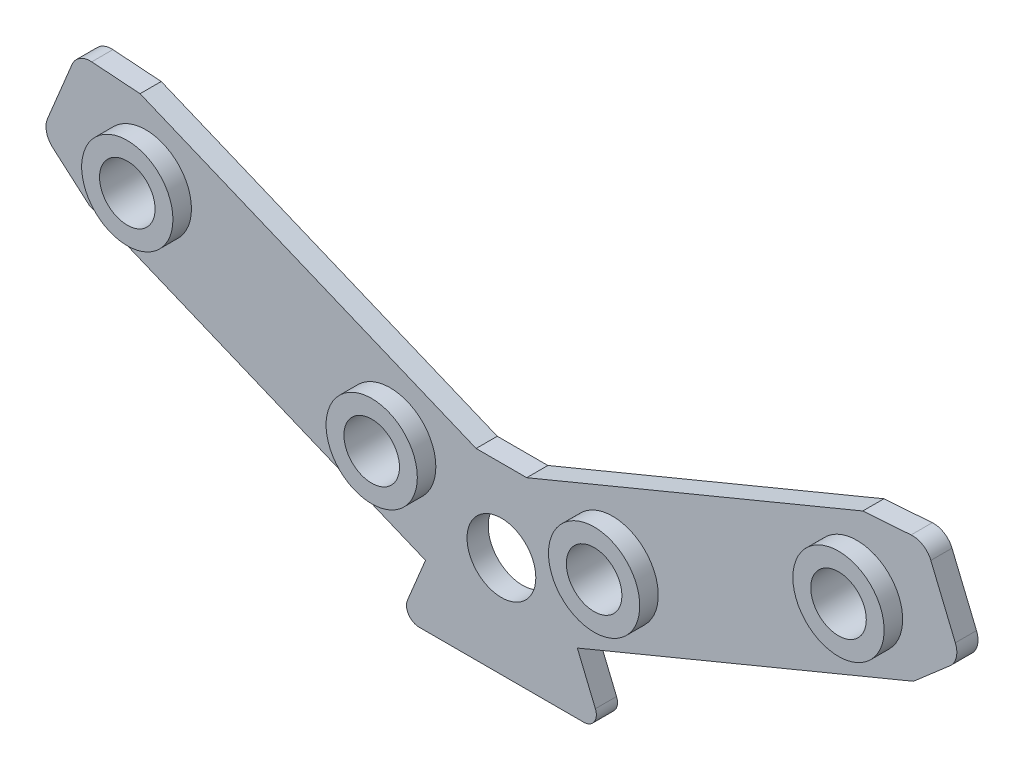
ISO-10303-21;
HEADER;
FILE_DESCRIPTION(('STEP AP214'),'2;1');
FILE_NAME('part.step','',(''),(''),'','','');
FILE_SCHEMA(('AUTOMOTIVE_DESIGN { 1 0 10303 214 1 1 1 1 }'));
ENDSEC;
DATA;
#1=APPLICATION_CONTEXT('core data for automotive mechanical design processes');
#2=APPLICATION_PROTOCOL_DEFINITION('international standard','automotive_design',2000,#1);
#3=PRODUCT_CONTEXT('',#1,'mechanical');
#4=PRODUCT('Part','Part','',(#3));
#5=PRODUCT_RELATED_PRODUCT_CATEGORY('part','',(#4));
#6=PRODUCT_DEFINITION_FORMATION('','',#4);
#7=PRODUCT_DEFINITION_CONTEXT('part definition',#1,'design');
#8=PRODUCT_DEFINITION('design','',#6,#7);
#9=PRODUCT_DEFINITION_SHAPE('','',#8);
#10=(LENGTH_UNIT() NAMED_UNIT(*) SI_UNIT(.MILLI.,.METRE.));
#11=(NAMED_UNIT(*) PLANE_ANGLE_UNIT() SI_UNIT($,.RADIAN.));
#12=(NAMED_UNIT(*) SI_UNIT($,.STERADIAN.) SOLID_ANGLE_UNIT());
#13=UNCERTAINTY_MEASURE_WITH_UNIT(LENGTH_MEASURE(1.E-05),#10,'distance_accuracy_value','');
#14=(GEOMETRIC_REPRESENTATION_CONTEXT(3) GLOBAL_UNCERTAINTY_ASSIGNED_CONTEXT((#13)) GLOBAL_UNIT_ASSIGNED_CONTEXT((#10,
#11,#12)) REPRESENTATION_CONTEXT('',''));
#15=CARTESIAN_POINT('',(0.,0.,0.));
#16=DIRECTION('',(0.,0.,1.));
#17=DIRECTION('',(1.,0.,0.));
#18=AXIS2_PLACEMENT_3D('',#15,#16,#17);
#19=CARTESIAN_POINT('',(-6.21700995331753,-6.69363433460637,1.6));
#20=DIRECTION('',(0.,0.,1.));
#21=DIRECTION('',(1.,0.,0.));
#22=AXIS2_PLACEMENT_3D('',#19,#20,#21);
#23=PLANE('',#22);
#24=CARTESIAN_POINT('',(-8.4073037458527,3.48241923452234,1.6));
#25=DIRECTION('',(0.,0.,1.));
#26=DIRECTION('',(1.,0.,0.));
#27=AXIS2_PLACEMENT_3D('',#24,#25,#26);
#28=CIRCLE('',#27,3.45);
#29=CARTESIAN_POINT('',(-4.9573037458527,3.48241923452234,1.6));
#30=VERTEX_POINT('',#29);
#31=EDGE_CURVE('E454',#30,#30,#28,.T.);
#32=ORIENTED_EDGE('',*,*,#31,.F.);
#33=EDGE_LOOP('',(#32));
#34=FACE_BOUND('',#33,.T.);
#35=CARTESIAN_POINT('',(26.8848943960784,11.1360878818242,1.6));
#36=DIRECTION('',(0.,0.,1.));
#37=DIRECTION('',(-1.,0.,0.));
#38=AXIS2_PLACEMENT_3D('',#35,#36,#37);
#39=CIRCLE('',#38,3.45);
#40=CARTESIAN_POINT('',(23.4348943960784,11.1360878818242,1.6));
#41=VERTEX_POINT('',#40);
#42=EDGE_CURVE('E466',#41,#41,#39,.T.);
#43=ORIENTED_EDGE('',*,*,#42,.F.);
#44=EDGE_LOOP('',(#43));
#45=FACE_BOUND('',#44,.T.);
#46=CARTESIAN_POINT('',(-6.21700995331753,-6.69363433460637,1.6));
#47=DIRECTION('',(0.,0.,1.));
#48=DIRECTION('',(1.,0.,0.));
#49=AXIS2_PLACEMENT_3D('',#46,#47,#48);
#50=CIRCLE('',#49,0.959999999999999);
#51=CARTESIAN_POINT('',(-7.10393430452836,-6.32625823953589,1.6));
#52=VERTEX_POINT('',#51);
#53=CARTESIAN_POINT('',(-6.21700995331753,-7.65363433460637,1.6));
#54=VERTEX_POINT('',#53);
#55=EDGE_CURVE('E243',#52,#54,#50,.T.);
#56=ORIENTED_EDGE('',*,*,#55,.T.);
#57=DIRECTION('',(1.,0.,0.));
#58=VECTOR('',#57,1.);
#59=CARTESIAN_POINT('',(6.21700995331753,-7.65363433460637,1.6));
#60=LINE('',#59,#58);
#61=CARTESIAN_POINT('',(6.21700995331753,-7.65363433460637,1.6));
#62=VERTEX_POINT('',#61);
#63=EDGE_CURVE('E131',#54,#62,#60,.T.);
#64=ORIENTED_EDGE('',*,*,#63,.T.);
#65=CARTESIAN_POINT('',(6.21700995331753,-6.69363433460637,1.6));
#66=DIRECTION('',(0.,0.,1.));
#67=DIRECTION('',(-1.,0.,0.));
#68=AXIS2_PLACEMENT_3D('',#65,#66,#67);
#69=CIRCLE('',#68,0.959999999999999);
#70=CARTESIAN_POINT('',(7.10393430452836,-6.32625823953589,1.6));
#71=VERTEX_POINT('',#70);
#72=EDGE_CURVE('E294',#62,#71,#69,.T.);
#73=ORIENTED_EDGE('',*,*,#72,.T.);
#74=DIRECTION('',(-0.382683432365094,0.923879532511285,0.));
#75=VECTOR('',#74,1.);
#76=CARTESIAN_POINT('',(5.74033432365094,-3.03423667204995,1.6));
#77=LINE('',#76,#75);
#78=CARTESIAN_POINT('',(5.74033432365094,-3.03423667204995,1.6));
#79=VERTEX_POINT('',#78);
#80=EDGE_CURVE('E313',#71,#79,#77,.T.);
#81=ORIENTED_EDGE('',*,*,#80,.T.);
#82=DIRECTION('',(0.923879532511285,0.382683432365093,0.));
#83=VECTOR('',#82,1.);
#84=CARTESIAN_POINT('',(5.74033432365094,-3.03423667204995,1.6));
#85=LINE('',#84,#83);
#86=CARTESIAN_POINT('',(31.1470214677113,7.48955771799011,1.6));
#87=VERTEX_POINT('',#86);
#88=EDGE_CURVE('E310',#79,#87,#85,.T.);
#89=ORIENTED_EDGE('',*,*,#88,.T.);
#90=DIRECTION('',(0.755453954995703,0.655201741360133,0.));
#91=VECTOR('',#90,1.);
#92=CARTESIAN_POINT('',(31.1470214677113,7.48955771799011,1.6));
#93=LINE('',#92,#91);
#94=CARTESIAN_POINT('',(33.9137036103779,9.88908841827675,1.6));
#95=VERTEX_POINT('',#94);
#96=EDGE_CURVE('E312',#87,#95,#93,.T.);
#97=ORIENTED_EDGE('',*,*,#96,.T.);
#98=CARTESIAN_POINT('',(32.9309009983377,11.0222693507703,1.6));
#99=DIRECTION('',(0.,0.,1.));
#100=DIRECTION('',(1.,0.,0.));
#101=AXIS2_PLACEMENT_3D('',#98,#99,#100);
#102=CIRCLE('',#101,1.5);
#103=CARTESIAN_POINT('',(34.3167202971046,11.596294499318,1.6));
#104=VERTEX_POINT('',#103);
#105=EDGE_CURVE('E315',#95,#104,#102,.T.);
#106=ORIENTED_EDGE('',*,*,#105,.T.);
#107=DIRECTION('',(-0.382683432365094,0.923879532511285,0.));
#108=VECTOR('',#107,1.);
#109=CARTESIAN_POINT('',(32.4654041072686,16.065767153061,1.6));
#110=LINE('',#109,#108);
#111=CARTESIAN_POINT('',(32.4654041072686,16.065767153061,1.6));
#112=VERTEX_POINT('',#111);
#113=EDGE_CURVE('E321',#104,#112,#110,.T.);
#114=ORIENTED_EDGE('',*,*,#113,.T.);
#115=CARTESIAN_POINT('',(31.0795848085016,15.4917420045133,1.6));
#116=DIRECTION('',(0.,0.,1.));
#117=DIRECTION('',(-1.,0.,0.));
#118=AXIS2_PLACEMENT_3D('',#115,#116,#117);
#119=CIRCLE('',#118,1.5);
#120=CARTESIAN_POINT('',(30.9732512783656,16.9879683177323,1.6));
#121=VERTEX_POINT('',#120);
#122=EDGE_CURVE('E323',#112,#121,#119,.T.);
#123=ORIENTED_EDGE('',*,*,#122,.T.);
#124=DIRECTION('',(-0.997484208812642,-0.0708890200906806,0.));
#125=VECTOR('',#124,1.);
#126=CARTESIAN_POINT('',(27.3201871440603,16.728353043103,1.6));
#127=LINE('',#126,#125);
#128=CARTESIAN_POINT('',(27.3201871440603,16.728353043103,1.6));
#129=VERTEX_POINT('',#128);
#130=EDGE_CURVE('E325',#121,#129,#127,.T.);
#131=ORIENTED_EDGE('',*,*,#130,.T.);
#132=DIRECTION('',(-0.923879532511285,-0.382683432365094,0.));
#133=VECTOR('',#132,1.);
#134=CARTESIAN_POINT('',(1.9135,6.2045586530629,1.6));
#135=LINE('',#134,#133);
#136=CARTESIAN_POINT('',(1.9135,6.2045586530629,1.6));
#137=VERTEX_POINT('',#136);
#138=EDGE_CURVE('E327',#129,#137,#135,.T.);
#139=ORIENTED_EDGE('',*,*,#138,.T.);
#140=DIRECTION('',(-1.,0.,0.));
#141=VECTOR('',#140,1.);
#142=CARTESIAN_POINT('',(-1.9135,6.2045586530629,1.6));
#143=LINE('',#142,#141);
#144=CARTESIAN_POINT('',(-1.9135,6.2045586530629,1.6));
#145=VERTEX_POINT('',#144);
#146=EDGE_CURVE('E329',#137,#145,#143,.T.);
#147=ORIENTED_EDGE('',*,*,#146,.T.);
#148=DIRECTION('',(-0.923879532511285,0.382683432365094,0.));
#149=VECTOR('',#148,1.);
#150=CARTESIAN_POINT('',(-1.9135,6.2045586530629,1.6));
#151=LINE('',#150,#149);
#152=CARTESIAN_POINT('',(-27.3201871440603,16.728353043103,1.6));
#153=VERTEX_POINT('',#152);
#154=EDGE_CURVE('E331',#145,#153,#151,.T.);
#155=ORIENTED_EDGE('',*,*,#154,.T.);
#156=DIRECTION('',(-0.997484208812642,0.0708890200906806,0.));
#157=VECTOR('',#156,1.);
#158=CARTESIAN_POINT('',(-27.3201871440603,16.728353043103,1.6));
#159=LINE('',#158,#157);
#160=CARTESIAN_POINT('',(-30.9732512783656,16.9879683177323,1.6));
#161=VERTEX_POINT('',#160);
#162=EDGE_CURVE('E333',#153,#161,#159,.T.);
#163=ORIENTED_EDGE('',*,*,#162,.T.);
#164=CARTESIAN_POINT('',(-31.0795848085016,15.4917420045133,1.6));
#165=DIRECTION('',(0.,0.,1.));
#166=DIRECTION('',(-1.,0.,0.));
#167=AXIS2_PLACEMENT_3D('',#164,#165,#166);
#168=CIRCLE('',#167,1.5);
#169=CARTESIAN_POINT('',(-32.4654041072686,16.065767153061,1.6));
#170=VERTEX_POINT('',#169);
#171=EDGE_CURVE('E335',#161,#170,#168,.T.);
#172=ORIENTED_EDGE('',*,*,#171,.T.);
#173=DIRECTION('',(-0.382683432365094,-0.923879532511285,0.));
#174=VECTOR('',#173,1.);
#175=CARTESIAN_POINT('',(-32.4654041072686,16.065767153061,1.6));
#176=LINE('',#175,#174);
#177=CARTESIAN_POINT('',(-34.3167202971046,11.5962944993179,1.6));
#178=VERTEX_POINT('',#177);
#179=EDGE_CURVE('E337',#170,#178,#176,.T.);
#180=ORIENTED_EDGE('',*,*,#179,.T.);
#181=CARTESIAN_POINT('',(-32.9309009983377,11.0222693507703,1.6));
#182=DIRECTION('',(0.,0.,1.));
#183=DIRECTION('',(-1.,0.,0.));
#184=AXIS2_PLACEMENT_3D('',#181,#182,#183);
#185=CIRCLE('',#184,1.5);
#186=CARTESIAN_POINT('',(-33.9137036103779,9.88908841827676,1.6));
#187=VERTEX_POINT('',#186);
#188=EDGE_CURVE('E186',#178,#187,#185,.T.);
#189=ORIENTED_EDGE('',*,*,#188,.T.);
#190=DIRECTION('',(0.7554539549957,-0.655201741360137,0.));
#191=VECTOR('',#190,1.);
#192=CARTESIAN_POINT('',(-31.1470214677113,7.48955771799011,1.6));
#193=LINE('',#192,#191);
#194=CARTESIAN_POINT('',(-31.1470214677113,7.48955771799011,1.6));
#195=VERTEX_POINT('',#194);
#196=EDGE_CURVE('E180',#187,#195,#193,.T.);
#197=ORIENTED_EDGE('',*,*,#196,.T.);
#198=DIRECTION('',(0.923879532511285,-0.382683432365093,0.));
#199=VECTOR('',#198,1.);
#200=CARTESIAN_POINT('',(-5.74033432365094,-3.03423667204995,1.6));
#201=LINE('',#200,#199);
#202=CARTESIAN_POINT('',(-5.74033432365094,-3.03423667204995,1.6));
#203=VERTEX_POINT('',#202);
#204=EDGE_CURVE('E184',#195,#203,#201,.T.);
#205=ORIENTED_EDGE('',*,*,#204,.T.);
#206=DIRECTION('',(-0.382683432365094,-0.923879532511285,0.));
#207=VECTOR('',#206,1.);
#208=CARTESIAN_POINT('',(-5.74033432365094,-3.03423667204995,1.6));
#209=LINE('',#208,#207);
#210=EDGE_CURVE('E52',#203,#52,#209,.T.);
#211=ORIENTED_EDGE('',*,*,#210,.T.);
#212=EDGE_LOOP('',(#56,#64,#73,#81,#89,#97,#106,#114,#123,#131,#139,#147,#155,#163,#172,#180,
#189,#197,#205,#211));
#213=FACE_BOUND('',#212,.T.);
#214=CARTESIAN_POINT('',(0.,0.,1.6));
#215=DIRECTION('',(0.,0.,1.));
#216=DIRECTION('',(1.,0.,0.));
#217=AXIS2_PLACEMENT_3D('',#214,#215,#216);
#218=CIRCLE('',#217,2.6);
#219=CARTESIAN_POINT('',(2.6,0.,1.6));
#220=VERTEX_POINT('',#219);
#221=EDGE_CURVE('E208',#220,#220,#218,.T.);
#222=ORIENTED_EDGE('',*,*,#221,.F.);
#223=EDGE_LOOP('',(#222));
#224=FACE_BOUND('',#223,.T.);
#225=CARTESIAN_POINT('',(8.4073037458527,3.48241923452234,1.6));
#226=DIRECTION('',(0.,0.,1.));
#227=DIRECTION('',(-1.,0.,0.));
#228=AXIS2_PLACEMENT_3D('',#225,#226,#227);
#229=CIRCLE('',#228,3.45);
#230=CARTESIAN_POINT('',(4.9573037458527,3.48241923452234,1.6));
#231=VERTEX_POINT('',#230);
#232=EDGE_CURVE('E460',#231,#231,#229,.T.);
#233=ORIENTED_EDGE('',*,*,#232,.F.);
#234=EDGE_LOOP('',(#233));
#235=FACE_BOUND('',#234,.T.);
#236=CARTESIAN_POINT('',(-26.8848943960784,11.1360878818242,1.6));
#237=DIRECTION('',(0.,0.,1.));
#238=DIRECTION('',(1.,0.,0.));
#239=AXIS2_PLACEMENT_3D('',#236,#237,#238);
#240=CIRCLE('',#239,3.45);
#241=CARTESIAN_POINT('',(-23.4348943960784,11.1360878818242,1.6));
#242=VERTEX_POINT('',#241);
#243=EDGE_CURVE('E450',#242,#242,#240,.T.);
#244=ORIENTED_EDGE('',*,*,#243,.F.);
#245=EDGE_LOOP('',(#244));
#246=FACE_BOUND('',#245,.T.);
#247=ADVANCED_FACE('F35',(#34,#45,#213,#224,#235,#246),#23,.T.);
#248=CARTESIAN_POINT('',(-6.21700995331753,-6.69363433460637,0.));
#249=DIRECTION('',(0.,0.,1.));
#250=DIRECTION('',(1.,0.,0.));
#251=AXIS2_PLACEMENT_3D('',#248,#249,#250);
#252=PLANE('',#251);
#253=CARTESIAN_POINT('',(26.8848943960784,11.1360878818242,0.));
#254=DIRECTION('',(0.,0.,1.));
#255=DIRECTION('',(1.,0.,0.));
#256=AXIS2_PLACEMENT_3D('',#253,#254,#255);
#257=CIRCLE('',#256,2.1);
#258=CARTESIAN_POINT('',(28.9848943960784,11.1360878818242,0.));
#259=VERTEX_POINT('',#258);
#260=EDGE_CURVE('E425',#259,#259,#257,.T.);
#261=ORIENTED_EDGE('',*,*,#260,.T.);
#262=EDGE_LOOP('',(#261));
#263=FACE_BOUND('',#262,.T.);
#264=CARTESIAN_POINT('',(8.4073037458527,3.48241923452234,0.));
#265=DIRECTION('',(0.,0.,1.));
#266=DIRECTION('',(1.,0.,0.));
#267=AXIS2_PLACEMENT_3D('',#264,#265,#266);
#268=CIRCLE('',#267,2.1);
#269=CARTESIAN_POINT('',(10.5073037458527,3.48241923452234,0.));
#270=VERTEX_POINT('',#269);
#271=EDGE_CURVE('E435',#270,#270,#268,.T.);
#272=ORIENTED_EDGE('',*,*,#271,.T.);
#273=EDGE_LOOP('',(#272));
#274=FACE_BOUND('',#273,.T.);
#275=CARTESIAN_POINT('',(-8.4073037458527,3.48241923452234,0.));
#276=DIRECTION('',(0.,0.,1.));
#277=DIRECTION('',(1.,0.,0.));
#278=AXIS2_PLACEMENT_3D('',#275,#276,#277);
#279=CIRCLE('',#278,2.1);
#280=CARTESIAN_POINT('',(-6.3073037458527,3.48241923452234,0.));
#281=VERTEX_POINT('',#280);
#282=EDGE_CURVE('E441',#281,#281,#279,.T.);
#283=ORIENTED_EDGE('',*,*,#282,.T.);
#284=EDGE_LOOP('',(#283));
#285=FACE_BOUND('',#284,.T.);
#286=CARTESIAN_POINT('',(-26.8848943960784,11.1360878818242,0.));
#287=DIRECTION('',(0.,0.,1.));
#288=DIRECTION('',(1.,0.,0.));
#289=AXIS2_PLACEMENT_3D('',#286,#287,#288);
#290=CIRCLE('',#289,2.1);
#291=CARTESIAN_POINT('',(-24.7848943960784,11.1360878818242,0.));
#292=VERTEX_POINT('',#291);
#293=EDGE_CURVE('E447',#292,#292,#290,.T.);
#294=ORIENTED_EDGE('',*,*,#293,.T.);
#295=EDGE_LOOP('',(#294));
#296=FACE_BOUND('',#295,.T.);
#297=CARTESIAN_POINT('',(-6.21700995331753,-6.69363433460637,0.));
#298=DIRECTION('',(0.,0.,1.));
#299=DIRECTION('',(1.,0.,0.));
#300=AXIS2_PLACEMENT_3D('',#297,#298,#299);
#301=CIRCLE('',#300,0.959999999999999);
#302=CARTESIAN_POINT('',(-7.10393430452836,-6.32625823953589,0.));
#303=VERTEX_POINT('',#302);
#304=CARTESIAN_POINT('',(-6.21700995331753,-7.65363433460637,0.));
#305=VERTEX_POINT('',#304);
#306=EDGE_CURVE('E204',#303,#305,#301,.T.);
#307=ORIENTED_EDGE('',*,*,#306,.F.);
#308=DIRECTION('',(-0.382683432365094,-0.923879532511285,0.));
#309=VECTOR('',#308,1.);
#310=CARTESIAN_POINT('',(-5.74033432365094,-3.03423667204995,0.));
#311=LINE('',#310,#309);
#312=CARTESIAN_POINT('',(-5.74033432365094,-3.03423667204995,0.));
#313=VERTEX_POINT('',#312);
#314=EDGE_CURVE('E123',#313,#303,#311,.T.);
#315=ORIENTED_EDGE('',*,*,#314,.F.);
#316=DIRECTION('',(0.923879532511285,-0.382683432365093,0.));
#317=VECTOR('',#316,1.);
#318=CARTESIAN_POINT('',(-5.74033432365094,-3.03423667204995,0.));
#319=LINE('',#318,#317);
#320=CARTESIAN_POINT('',(-31.1470214677113,7.48955771799011,0.));
#321=VERTEX_POINT('',#320);
#322=EDGE_CURVE('E117',#321,#313,#319,.T.);
#323=ORIENTED_EDGE('',*,*,#322,.F.);
#324=DIRECTION('',(0.7554539549957,-0.655201741360137,0.));
#325=VECTOR('',#324,1.);
#326=CARTESIAN_POINT('',(-31.1470214677113,7.48955771799011,0.));
#327=LINE('',#326,#325);
#328=CARTESIAN_POINT('',(-33.9137036103779,9.88908841827676,0.));
#329=VERTEX_POINT('',#328);
#330=EDGE_CURVE('E194',#329,#321,#327,.T.);
#331=ORIENTED_EDGE('',*,*,#330,.F.);
#332=CARTESIAN_POINT('',(-32.9309009983377,11.0222693507703,0.));
#333=DIRECTION('',(0.,0.,1.));
#334=DIRECTION('',(-1.,0.,0.));
#335=AXIS2_PLACEMENT_3D('',#332,#333,#334);
#336=CIRCLE('',#335,1.5);
#337=CARTESIAN_POINT('',(-34.3167202971046,11.5962944993179,0.));
#338=VERTEX_POINT('',#337);
#339=EDGE_CURVE('E238',#338,#329,#336,.T.);
#340=ORIENTED_EDGE('',*,*,#339,.F.);
#341=DIRECTION('',(-0.382683432365094,-0.923879532511285,0.));
#342=VECTOR('',#341,1.);
#343=CARTESIAN_POINT('',(-32.4654041072686,16.065767153061,0.));
#344=LINE('',#343,#342);
#345=CARTESIAN_POINT('',(-32.4654041072686,16.065767153061,0.));
#346=VERTEX_POINT('',#345);
#347=EDGE_CURVE('E236',#346,#338,#344,.T.);
#348=ORIENTED_EDGE('',*,*,#347,.F.);
#349=CARTESIAN_POINT('',(-31.0795848085016,15.4917420045133,0.));
#350=DIRECTION('',(0.,0.,1.));
#351=DIRECTION('',(-1.,0.,0.));
#352=AXIS2_PLACEMENT_3D('',#349,#350,#351);
#353=CIRCLE('',#352,1.5);
#354=CARTESIAN_POINT('',(-30.9732512783656,16.9879683177323,0.));
#355=VERTEX_POINT('',#354);
#356=EDGE_CURVE('E234',#355,#346,#353,.T.);
#357=ORIENTED_EDGE('',*,*,#356,.F.);
#358=DIRECTION('',(-0.997484208812642,0.0708890200906806,0.));
#359=VECTOR('',#358,1.);
#360=CARTESIAN_POINT('',(-27.3201871440603,16.728353043103,0.));
#361=LINE('',#360,#359);
#362=CARTESIAN_POINT('',(-27.3201871440603,16.728353043103,0.));
#363=VERTEX_POINT('',#362);
#364=EDGE_CURVE('E232',#363,#355,#361,.T.);
#365=ORIENTED_EDGE('',*,*,#364,.F.);
#366=DIRECTION('',(-0.923879532511285,0.382683432365094,0.));
#367=VECTOR('',#366,1.);
#368=CARTESIAN_POINT('',(-1.9135,6.2045586530629,0.));
#369=LINE('',#368,#367);
#370=CARTESIAN_POINT('',(-1.9135,6.2045586530629,0.));
#371=VERTEX_POINT('',#370);
#372=EDGE_CURVE('E230',#371,#363,#369,.T.);
#373=ORIENTED_EDGE('',*,*,#372,.F.);
#374=DIRECTION('',(-1.,0.,0.));
#375=VECTOR('',#374,1.);
#376=CARTESIAN_POINT('',(-1.9135,6.2045586530629,0.));
#377=LINE('',#376,#375);
#378=CARTESIAN_POINT('',(1.9135,6.2045586530629,0.));
#379=VERTEX_POINT('',#378);
#380=EDGE_CURVE('E228',#379,#371,#377,.T.);
#381=ORIENTED_EDGE('',*,*,#380,.F.);
#382=DIRECTION('',(-0.923879532511285,-0.382683432365094,0.));
#383=VECTOR('',#382,1.);
#384=CARTESIAN_POINT('',(1.9135,6.2045586530629,0.));
#385=LINE('',#384,#383);
#386=CARTESIAN_POINT('',(27.3201871440603,16.728353043103,0.));
#387=VERTEX_POINT('',#386);
#388=EDGE_CURVE('E226',#387,#379,#385,.T.);
#389=ORIENTED_EDGE('',*,*,#388,.F.);
#390=DIRECTION('',(-0.997484208812642,-0.0708890200906806,0.));
#391=VECTOR('',#390,1.);
#392=CARTESIAN_POINT('',(27.3201871440603,16.728353043103,0.));
#393=LINE('',#392,#391);
#394=CARTESIAN_POINT('',(30.9732512783656,16.9879683177323,0.));
#395=VERTEX_POINT('',#394);
#396=EDGE_CURVE('E224',#395,#387,#393,.T.);
#397=ORIENTED_EDGE('',*,*,#396,.F.);
#398=CARTESIAN_POINT('',(31.0795848085016,15.4917420045133,0.));
#399=DIRECTION('',(0.,0.,1.));
#400=DIRECTION('',(-1.,0.,0.));
#401=AXIS2_PLACEMENT_3D('',#398,#399,#400);
#402=CIRCLE('',#401,1.5);
#403=CARTESIAN_POINT('',(32.4654041072686,16.065767153061,0.));
#404=VERTEX_POINT('',#403);
#405=EDGE_CURVE('E222',#404,#395,#402,.T.);
#406=ORIENTED_EDGE('',*,*,#405,.F.);
#407=DIRECTION('',(-0.382683432365094,0.923879532511285,0.));
#408=VECTOR('',#407,1.);
#409=CARTESIAN_POINT('',(32.4654041072686,16.065767153061,0.));
#410=LINE('',#409,#408);
#411=CARTESIAN_POINT('',(34.3167202971046,11.596294499318,0.));
#412=VERTEX_POINT('',#411);
#413=EDGE_CURVE('E220',#412,#404,#410,.T.);
#414=ORIENTED_EDGE('',*,*,#413,.F.);
#415=CARTESIAN_POINT('',(32.9309009983377,11.0222693507703,0.));
#416=DIRECTION('',(0.,0.,1.));
#417=DIRECTION('',(1.,0.,0.));
#418=AXIS2_PLACEMENT_3D('',#415,#416,#417);
#419=CIRCLE('',#418,1.5);
#420=CARTESIAN_POINT('',(33.9137036103779,9.88908841827675,0.));
#421=VERTEX_POINT('',#420);
#422=EDGE_CURVE('E218',#421,#412,#419,.T.);
#423=ORIENTED_EDGE('',*,*,#422,.F.);
#424=DIRECTION('',(0.755453954995703,0.655201741360133,0.));
#425=VECTOR('',#424,1.);
#426=CARTESIAN_POINT('',(31.1470214677113,7.48955771799011,0.));
#427=LINE('',#426,#425);
#428=CARTESIAN_POINT('',(31.1470214677113,7.48955771799011,0.));
#429=VERTEX_POINT('',#428);
#430=EDGE_CURVE('E216',#429,#421,#427,.T.);
#431=ORIENTED_EDGE('',*,*,#430,.F.);
#432=DIRECTION('',(0.923879532511285,0.382683432365093,0.));
#433=VECTOR('',#432,1.);
#434=CARTESIAN_POINT('',(5.74033432365094,-3.03423667204995,0.));
#435=LINE('',#434,#433);
#436=CARTESIAN_POINT('',(5.74033432365094,-3.03423667204995,0.));
#437=VERTEX_POINT('',#436);
#438=EDGE_CURVE('E214',#437,#429,#435,.T.);
#439=ORIENTED_EDGE('',*,*,#438,.F.);
#440=DIRECTION('',(-0.382683432365094,0.923879532511285,0.));
#441=VECTOR('',#440,1.);
#442=CARTESIAN_POINT('',(5.74033432365094,-3.03423667204995,0.));
#443=LINE('',#442,#441);
#444=CARTESIAN_POINT('',(7.10393430452836,-6.32625823953589,0.));
#445=VERTEX_POINT('',#444);
#446=EDGE_CURVE('E212',#445,#437,#443,.T.);
#447=ORIENTED_EDGE('',*,*,#446,.F.);
#448=CARTESIAN_POINT('',(6.21700995331753,-6.69363433460637,0.));
#449=DIRECTION('',(0.,0.,1.));
#450=DIRECTION('',(-1.,0.,0.));
#451=AXIS2_PLACEMENT_3D('',#448,#449,#450);
#452=CIRCLE('',#451,0.959999999999999);
#453=CARTESIAN_POINT('',(6.21700995331753,-7.65363433460637,0.));
#454=VERTEX_POINT('',#453);
#455=EDGE_CURVE('E210',#454,#445,#452,.T.);
#456=ORIENTED_EDGE('',*,*,#455,.F.);
#457=DIRECTION('',(1.,0.,0.));
#458=VECTOR('',#457,1.);
#459=CARTESIAN_POINT('',(6.21700995331753,-7.65363433460637,0.));
#460=LINE('',#459,#458);
#461=EDGE_CURVE('E207',#305,#454,#460,.T.);
#462=ORIENTED_EDGE('',*,*,#461,.F.);
#463=EDGE_LOOP('',(#307,#315,#323,#331,#340,#348,#357,#365,#373,#381,#389,#397,#406,#414,#423,
#431,#439,#447,#456,#462));
#464=FACE_BOUND('',#463,.T.);
#465=CARTESIAN_POINT('',(0.,0.,0.));
#466=DIRECTION('',(0.,0.,1.));
#467=DIRECTION('',(1.,0.,0.));
#468=AXIS2_PLACEMENT_3D('',#465,#466,#467);
#469=CIRCLE('',#468,2.6);
#470=CARTESIAN_POINT('',(2.6,0.,0.));
#471=VERTEX_POINT('',#470);
#472=EDGE_CURVE('E472',#471,#471,#469,.T.);
#473=ORIENTED_EDGE('',*,*,#472,.T.);
#474=EDGE_LOOP('',(#473));
#475=FACE_BOUND('',#474,.T.);
#476=ADVANCED_FACE('F298',(#263,#274,#285,#296,#464,#475),#252,.F.);
#477=CARTESIAN_POINT('',(-6.21700995331753,-6.69363433460637,1.6));
#478=DIRECTION('',(0.,0.,-1.));
#479=DIRECTION('',(-1.,0.,0.));
#480=AXIS2_PLACEMENT_3D('',#477,#478,#479);
#481=CYLINDRICAL_SURFACE('',#480,0.959999999999999);
#482=ORIENTED_EDGE('',*,*,#306,.T.);
#483=DIRECTION('',(0.,0.,-1.));
#484=VECTOR('',#483,1.);
#485=CARTESIAN_POINT('',(-6.21700995331753,-7.65363433460637,1.6));
#486=LINE('',#485,#484);
#487=EDGE_CURVE('E11',#54,#305,#486,.T.);
#488=ORIENTED_EDGE('',*,*,#487,.F.);
#489=ORIENTED_EDGE('',*,*,#55,.F.);
#490=DIRECTION('',(0.,0.,-1.));
#491=VECTOR('',#490,1.);
#492=CARTESIAN_POINT('',(-7.10393430452836,-6.32625823953589,1.6));
#493=LINE('',#492,#491);
#494=EDGE_CURVE('E200',#52,#303,#493,.T.);
#495=ORIENTED_EDGE('',*,*,#494,.T.);
#496=EDGE_LOOP('',(#482,#488,#489,#495));
#497=FACE_BOUND('',#496,.T.);
#498=ADVANCED_FACE('F37',(#497),#481,.T.);
#499=CARTESIAN_POINT('',(6.21700995331753,-7.65363433460637,1.6));
#500=DIRECTION('',(0.,1.,0.));
#501=DIRECTION('',(0.,0.,1.));
#502=AXIS2_PLACEMENT_3D('',#499,#500,#501);
#503=PLANE('',#502);
#504=ORIENTED_EDGE('',*,*,#461,.T.);
#505=DIRECTION('',(0.,0.,-1.));
#506=VECTOR('',#505,1.);
#507=CARTESIAN_POINT('',(6.21700995331753,-7.65363433460637,1.6));
#508=LINE('',#507,#506);
#509=EDGE_CURVE('E44',#62,#454,#508,.T.);
#510=ORIENTED_EDGE('',*,*,#509,.F.);
#511=ORIENTED_EDGE('',*,*,#63,.F.);
#512=ORIENTED_EDGE('',*,*,#487,.T.);
#513=EDGE_LOOP('',(#504,#510,#511,#512));
#514=FACE_BOUND('',#513,.T.);
#515=ADVANCED_FACE('F756',(#514),#503,.F.);
#516=CARTESIAN_POINT('',(6.21700995331753,-6.69363433460637,1.6));
#517=DIRECTION('',(0.,0.,-1.));
#518=DIRECTION('',(-1.,0.,0.));
#519=AXIS2_PLACEMENT_3D('',#516,#517,#518);
#520=CYLINDRICAL_SURFACE('',#519,0.959999999999999);
#521=ORIENTED_EDGE('',*,*,#455,.T.);
#522=DIRECTION('',(0.,0.,-1.));
#523=VECTOR('',#522,1.);
#524=CARTESIAN_POINT('',(7.10393430452836,-6.32625823953589,1.6));
#525=LINE('',#524,#523);
#526=EDGE_CURVE('E286',#71,#445,#525,.T.);
#527=ORIENTED_EDGE('',*,*,#526,.F.);
#528=ORIENTED_EDGE('',*,*,#72,.F.);
#529=ORIENTED_EDGE('',*,*,#509,.T.);
#530=EDGE_LOOP('',(#521,#527,#528,#529));
#531=FACE_BOUND('',#530,.T.);
#532=ADVANCED_FACE('F292',(#531),#520,.T.);
#533=CARTESIAN_POINT('',(5.74033432365094,-3.03423667204995,1.6));
#534=DIRECTION('',(-0.923879532511285,-0.382683432365094,0.));
#535=DIRECTION('',(0.382683432365094,-0.923879532511285,0.));
#536=AXIS2_PLACEMENT_3D('',#533,#534,#535);
#537=PLANE('',#536);
#538=ORIENTED_EDGE('',*,*,#446,.T.);
#539=DIRECTION('',(0.,0.,-1.));
#540=VECTOR('',#539,1.);
#541=CARTESIAN_POINT('',(5.74033432365094,-3.03423667204995,1.6));
#542=LINE('',#541,#540);
#543=EDGE_CURVE('E283',#79,#437,#542,.T.);
#544=ORIENTED_EDGE('',*,*,#543,.F.);
#545=ORIENTED_EDGE('',*,*,#80,.F.);
#546=ORIENTED_EDGE('',*,*,#526,.T.);
#547=EDGE_LOOP('',(#538,#544,#545,#546));
#548=FACE_BOUND('',#547,.T.);
#549=ADVANCED_FACE('F304',(#548),#537,.F.);
#550=CARTESIAN_POINT('',(5.74033432365094,-3.03423667204995,1.6));
#551=DIRECTION('',(-0.382683432365093,0.923879532511285,0.));
#552=DIRECTION('',(-0.923879532511285,-0.382683432365093,0.));
#553=AXIS2_PLACEMENT_3D('',#550,#551,#552);
#554=PLANE('',#553);
#555=ORIENTED_EDGE('',*,*,#438,.T.);
#556=DIRECTION('',(0.,0.,-1.));
#557=VECTOR('',#556,1.);
#558=CARTESIAN_POINT('',(31.1470214677113,7.48955771799011,1.6));
#559=LINE('',#558,#557);
#560=EDGE_CURVE('E280',#87,#429,#559,.T.);
#561=ORIENTED_EDGE('',*,*,#560,.F.);
#562=ORIENTED_EDGE('',*,*,#88,.F.);
#563=ORIENTED_EDGE('',*,*,#543,.T.);
#564=EDGE_LOOP('',(#555,#561,#562,#563));
#565=FACE_BOUND('',#564,.T.);
#566=ADVANCED_FACE('F308',(#565),#554,.F.);
#567=CARTESIAN_POINT('',(31.1470214677113,7.48955771799011,1.6));
#568=DIRECTION('',(-0.655201741360133,0.755453954995703,0.));
#569=DIRECTION('',(-0.755453954995703,-0.655201741360133,0.));
#570=AXIS2_PLACEMENT_3D('',#567,#568,#569);
#571=PLANE('',#570);
#572=ORIENTED_EDGE('',*,*,#430,.T.);
#573=DIRECTION('',(0.,0.,-1.));
#574=VECTOR('',#573,1.);
#575=CARTESIAN_POINT('',(33.9137036103779,9.88908841827675,1.6));
#576=LINE('',#575,#574);
#577=EDGE_CURVE('E277',#95,#421,#576,.T.);
#578=ORIENTED_EDGE('',*,*,#577,.F.);
#579=ORIENTED_EDGE('',*,*,#96,.F.);
#580=ORIENTED_EDGE('',*,*,#560,.T.);
#581=EDGE_LOOP('',(#572,#578,#579,#580));
#582=FACE_BOUND('',#581,.T.);
#583=ADVANCED_FACE('F721',(#582),#571,.F.);
#584=CARTESIAN_POINT('',(32.9309009983377,11.0222693507703,1.6));
#585=DIRECTION('',(0.,0.,-1.));
#586=DIRECTION('',(-1.,0.,0.));
#587=AXIS2_PLACEMENT_3D('',#584,#585,#586);
#588=CYLINDRICAL_SURFACE('',#587,1.5);
#589=ORIENTED_EDGE('',*,*,#422,.T.);
#590=DIRECTION('',(0.,0.,-1.));
#591=VECTOR('',#590,1.);
#592=CARTESIAN_POINT('',(34.3167202971046,11.596294499318,1.6));
#593=LINE('',#592,#591);
#594=EDGE_CURVE('E274',#104,#412,#593,.T.);
#595=ORIENTED_EDGE('',*,*,#594,.F.);
#596=ORIENTED_EDGE('',*,*,#105,.F.);
#597=ORIENTED_EDGE('',*,*,#577,.T.);
#598=EDGE_LOOP('',(#589,#595,#596,#597));
#599=FACE_BOUND('',#598,.T.);
#600=ADVANCED_FACE('F711',(#599),#588,.T.);
#601=CARTESIAN_POINT('',(32.4654041072686,16.065767153061,1.6));
#602=DIRECTION('',(-0.923879532511285,-0.382683432365094,0.));
#603=DIRECTION('',(0.382683432365094,-0.923879532511285,0.));
#604=AXIS2_PLACEMENT_3D('',#601,#602,#603);
#605=PLANE('',#604);
#606=ORIENTED_EDGE('',*,*,#413,.T.);
#607=DIRECTION('',(0.,0.,-1.));
#608=VECTOR('',#607,1.);
#609=CARTESIAN_POINT('',(32.4654041072686,16.065767153061,1.6));
#610=LINE('',#609,#608);
#611=EDGE_CURVE('E271',#112,#404,#610,.T.);
#612=ORIENTED_EDGE('',*,*,#611,.F.);
#613=ORIENTED_EDGE('',*,*,#113,.F.);
#614=ORIENTED_EDGE('',*,*,#594,.T.);
#615=EDGE_LOOP('',(#606,#612,#613,#614));
#616=FACE_BOUND('',#615,.T.);
#617=ADVANCED_FACE('F701',(#616),#605,.F.);
#618=CARTESIAN_POINT('',(31.0795848085016,15.4917420045133,1.6));
#619=DIRECTION('',(0.,0.,-1.));
#620=DIRECTION('',(-1.,0.,0.));
#621=AXIS2_PLACEMENT_3D('',#618,#619,#620);
#622=CYLINDRICAL_SURFACE('',#621,1.5);
#623=ORIENTED_EDGE('',*,*,#405,.T.);
#624=DIRECTION('',(0.,0.,-1.));
#625=VECTOR('',#624,1.);
#626=CARTESIAN_POINT('',(30.9732512783656,16.9879683177323,1.6));
#627=LINE('',#626,#625);
#628=EDGE_CURVE('E268',#121,#395,#627,.T.);
#629=ORIENTED_EDGE('',*,*,#628,.F.);
#630=ORIENTED_EDGE('',*,*,#122,.F.);
#631=ORIENTED_EDGE('',*,*,#611,.T.);
#632=EDGE_LOOP('',(#623,#629,#630,#631));
#633=FACE_BOUND('',#632,.T.);
#634=ADVANCED_FACE('F691',(#633),#622,.T.);
#635=CARTESIAN_POINT('',(27.3201871440603,16.728353043103,1.6));
#636=DIRECTION('',(0.0708890200906806,-0.997484208812642,0.));
#637=DIRECTION('',(0.997484208812642,0.0708890200906806,0.));
#638=AXIS2_PLACEMENT_3D('',#635,#636,#637);
#639=PLANE('',#638);
#640=ORIENTED_EDGE('',*,*,#396,.T.);
#641=DIRECTION('',(0.,0.,-1.));
#642=VECTOR('',#641,1.);
#643=CARTESIAN_POINT('',(27.3201871440603,16.728353043103,1.6));
#644=LINE('',#643,#642);
#645=EDGE_CURVE('E265',#129,#387,#644,.T.);
#646=ORIENTED_EDGE('',*,*,#645,.F.);
#647=ORIENTED_EDGE('',*,*,#130,.F.);
#648=ORIENTED_EDGE('',*,*,#628,.T.);
#649=EDGE_LOOP('',(#640,#646,#647,#648));
#650=FACE_BOUND('',#649,.T.);
#651=ADVANCED_FACE('F681',(#650),#639,.F.);
#652=CARTESIAN_POINT('',(1.9135,6.2045586530629,1.6));
#653=DIRECTION('',(0.382683432365094,-0.923879532511285,0.));
#654=DIRECTION('',(0.923879532511285,0.382683432365094,0.));
#655=AXIS2_PLACEMENT_3D('',#652,#653,#654);
#656=PLANE('',#655);
#657=ORIENTED_EDGE('',*,*,#388,.T.);
#658=DIRECTION('',(0.,0.,-1.));
#659=VECTOR('',#658,1.);
#660=CARTESIAN_POINT('',(1.9135,6.2045586530629,1.6));
#661=LINE('',#660,#659);
#662=EDGE_CURVE('E262',#137,#379,#661,.T.);
#663=ORIENTED_EDGE('',*,*,#662,.F.);
#664=ORIENTED_EDGE('',*,*,#138,.F.);
#665=ORIENTED_EDGE('',*,*,#645,.T.);
#666=EDGE_LOOP('',(#657,#663,#664,#665));
#667=FACE_BOUND('',#666,.T.);
#668=ADVANCED_FACE('F671',(#667),#656,.F.);
#669=CARTESIAN_POINT('',(-1.9135,6.2045586530629,1.6));
#670=DIRECTION('',(0.,-1.,0.));
#671=DIRECTION('',(0.,0.,-1.));
#672=AXIS2_PLACEMENT_3D('',#669,#670,#671);
#673=PLANE('',#672);
#674=ORIENTED_EDGE('',*,*,#380,.T.);
#675=DIRECTION('',(0.,0.,-1.));
#676=VECTOR('',#675,1.);
#677=CARTESIAN_POINT('',(-1.9135,6.2045586530629,1.6));
#678=LINE('',#677,#676);
#679=EDGE_CURVE('E259',#145,#371,#678,.T.);
#680=ORIENTED_EDGE('',*,*,#679,.F.);
#681=ORIENTED_EDGE('',*,*,#146,.F.);
#682=ORIENTED_EDGE('',*,*,#662,.T.);
#683=EDGE_LOOP('',(#674,#680,#681,#682));
#684=FACE_BOUND('',#683,.T.);
#685=ADVANCED_FACE('F661',(#684),#673,.F.);
#686=CARTESIAN_POINT('',(-1.9135,6.2045586530629,1.6));
#687=DIRECTION('',(-0.382683432365094,-0.923879532511285,0.));
#688=DIRECTION('',(0.923879532511285,-0.382683432365094,0.));
#689=AXIS2_PLACEMENT_3D('',#686,#687,#688);
#690=PLANE('',#689);
#691=ORIENTED_EDGE('',*,*,#372,.T.);
#692=DIRECTION('',(0.,0.,-1.));
#693=VECTOR('',#692,1.);
#694=CARTESIAN_POINT('',(-27.3201871440603,16.728353043103,1.6));
#695=LINE('',#694,#693);
#696=EDGE_CURVE('E256',#153,#363,#695,.T.);
#697=ORIENTED_EDGE('',*,*,#696,.F.);
#698=ORIENTED_EDGE('',*,*,#154,.F.);
#699=ORIENTED_EDGE('',*,*,#679,.T.);
#700=EDGE_LOOP('',(#691,#697,#698,#699));
#701=FACE_BOUND('',#700,.T.);
#702=ADVANCED_FACE('F651',(#701),#690,.F.);
#703=CARTESIAN_POINT('',(-27.3201871440603,16.728353043103,1.6));
#704=DIRECTION('',(-0.0708890200906806,-0.997484208812642,0.));
#705=DIRECTION('',(0.997484208812642,-0.0708890200906806,0.));
#706=AXIS2_PLACEMENT_3D('',#703,#704,#705);
#707=PLANE('',#706);
#708=ORIENTED_EDGE('',*,*,#364,.T.);
#709=DIRECTION('',(0.,0.,-1.));
#710=VECTOR('',#709,1.);
#711=CARTESIAN_POINT('',(-30.9732512783656,16.9879683177323,1.6));
#712=LINE('',#711,#710);
#713=EDGE_CURVE('E253',#161,#355,#712,.T.);
#714=ORIENTED_EDGE('',*,*,#713,.F.);
#715=ORIENTED_EDGE('',*,*,#162,.F.);
#716=ORIENTED_EDGE('',*,*,#696,.T.);
#717=EDGE_LOOP('',(#708,#714,#715,#716));
#718=FACE_BOUND('',#717,.T.);
#719=ADVANCED_FACE('F641',(#718),#707,.F.);
#720=CARTESIAN_POINT('',(-31.0795848085016,15.4917420045133,1.6));
#721=DIRECTION('',(0.,0.,-1.));
#722=DIRECTION('',(-1.,0.,0.));
#723=AXIS2_PLACEMENT_3D('',#720,#721,#722);
#724=CYLINDRICAL_SURFACE('',#723,1.5);
#725=ORIENTED_EDGE('',*,*,#356,.T.);
#726=DIRECTION('',(0.,0.,-1.));
#727=VECTOR('',#726,1.);
#728=CARTESIAN_POINT('',(-32.4654041072686,16.065767153061,1.6));
#729=LINE('',#728,#727);
#730=EDGE_CURVE('E250',#170,#346,#729,.T.);
#731=ORIENTED_EDGE('',*,*,#730,.F.);
#732=ORIENTED_EDGE('',*,*,#171,.F.);
#733=ORIENTED_EDGE('',*,*,#713,.T.);
#734=EDGE_LOOP('',(#725,#731,#732,#733));
#735=FACE_BOUND('',#734,.T.);
#736=ADVANCED_FACE('F632',(#735),#724,.T.);
#737=CARTESIAN_POINT('',(-32.4654041072686,16.065767153061,1.6));
#738=DIRECTION('',(0.923879532511285,-0.382683432365094,0.));
#739=DIRECTION('',(0.382683432365094,0.923879532511285,0.));
#740=AXIS2_PLACEMENT_3D('',#737,#738,#739);
#741=PLANE('',#740);
#742=ORIENTED_EDGE('',*,*,#347,.T.);
#743=DIRECTION('',(0.,0.,-1.));
#744=VECTOR('',#743,1.);
#745=CARTESIAN_POINT('',(-34.3167202971046,11.5962944993179,1.6));
#746=LINE('',#745,#744);
#747=EDGE_CURVE('E247',#178,#338,#746,.T.);
#748=ORIENTED_EDGE('',*,*,#747,.F.);
#749=ORIENTED_EDGE('',*,*,#179,.F.);
#750=ORIENTED_EDGE('',*,*,#730,.T.);
#751=EDGE_LOOP('',(#742,#748,#749,#750));
#752=FACE_BOUND('',#751,.T.);
#753=ADVANCED_FACE('F343',(#752),#741,.F.);
#754=CARTESIAN_POINT('',(-32.9309009983377,11.0222693507703,1.6));
#755=DIRECTION('',(0.,0.,-1.));
#756=DIRECTION('',(-1.,0.,0.));
#757=AXIS2_PLACEMENT_3D('',#754,#755,#756);
#758=CYLINDRICAL_SURFACE('',#757,1.5);
#759=ORIENTED_EDGE('',*,*,#339,.T.);
#760=DIRECTION('',(0.,0.,-1.));
#761=VECTOR('',#760,1.);
#762=CARTESIAN_POINT('',(-33.9137036103779,9.88908841827676,1.6));
#763=LINE('',#762,#761);
#764=EDGE_CURVE('E195',#187,#329,#763,.T.);
#765=ORIENTED_EDGE('',*,*,#764,.F.);
#766=ORIENTED_EDGE('',*,*,#188,.F.);
#767=ORIENTED_EDGE('',*,*,#747,.T.);
#768=EDGE_LOOP('',(#759,#765,#766,#767));
#769=FACE_BOUND('',#768,.T.);
#770=ADVANCED_FACE('F347',(#769),#758,.T.);
#771=CARTESIAN_POINT('',(-31.1470214677113,7.48955771799011,1.6));
#772=DIRECTION('',(0.655201741360136,0.7554539549957,0.));
#773=DIRECTION('',(-0.7554539549957,0.655201741360136,0.));
#774=AXIS2_PLACEMENT_3D('',#771,#772,#773);
#775=PLANE('',#774);
#776=ORIENTED_EDGE('',*,*,#330,.T.);
#777=DIRECTION('',(0.,0.,-1.));
#778=VECTOR('',#777,1.);
#779=CARTESIAN_POINT('',(-31.1470214677113,7.48955771799011,1.6));
#780=LINE('',#779,#778);
#781=EDGE_CURVE('E191',#195,#321,#780,.T.);
#782=ORIENTED_EDGE('',*,*,#781,.F.);
#783=ORIENTED_EDGE('',*,*,#196,.F.);
#784=ORIENTED_EDGE('',*,*,#764,.T.);
#785=EDGE_LOOP('',(#776,#782,#783,#784));
#786=FACE_BOUND('',#785,.T.);
#787=ADVANCED_FACE('F192',(#786),#775,.F.);
#788=CARTESIAN_POINT('',(-5.74033432365094,-3.03423667204995,1.6));
#789=DIRECTION('',(0.382683432365093,0.923879532511285,0.));
#790=DIRECTION('',(-0.923879532511285,0.382683432365093,0.));
#791=AXIS2_PLACEMENT_3D('',#788,#789,#790);
#792=PLANE('',#791);
#793=ORIENTED_EDGE('',*,*,#322,.T.);
#794=DIRECTION('',(0.,0.,-1.));
#795=VECTOR('',#794,1.);
#796=CARTESIAN_POINT('',(-5.74033432365094,-3.03423667204995,1.6));
#797=LINE('',#796,#795);
#798=EDGE_CURVE('E196',#203,#313,#797,.T.);
#799=ORIENTED_EDGE('',*,*,#798,.F.);
#800=ORIENTED_EDGE('',*,*,#204,.F.);
#801=ORIENTED_EDGE('',*,*,#781,.T.);
#802=EDGE_LOOP('',(#793,#799,#800,#801));
#803=FACE_BOUND('',#802,.T.);
#804=ADVANCED_FACE('F198',(#803),#792,.F.);
#805=CARTESIAN_POINT('',(-5.74033432365094,-3.03423667204995,1.6));
#806=DIRECTION('',(0.923879532511285,-0.382683432365094,0.));
#807=DIRECTION('',(0.382683432365094,0.923879532511285,0.));
#808=AXIS2_PLACEMENT_3D('',#805,#806,#807);
#809=PLANE('',#808);
#810=ORIENTED_EDGE('',*,*,#314,.T.);
#811=ORIENTED_EDGE('',*,*,#494,.F.);
#812=ORIENTED_EDGE('',*,*,#210,.F.);
#813=ORIENTED_EDGE('',*,*,#798,.T.);
#814=EDGE_LOOP('',(#810,#811,#812,#813));
#815=FACE_BOUND('',#814,.T.);
#816=ADVANCED_FACE('F351',(#815),#809,.F.);
#817=CARTESIAN_POINT('',(0.,0.,1.6));
#818=DIRECTION('',(0.,0.,-1.));
#819=DIRECTION('',(-1.,0.,0.));
#820=AXIS2_PLACEMENT_3D('',#817,#818,#819);
#821=CYLINDRICAL_SURFACE('',#820,2.6);
#822=ORIENTED_EDGE('',*,*,#221,.T.);
#823=EDGE_LOOP('',(#822));
#824=FACE_BOUND('',#823,.T.);
#825=ORIENTED_EDGE('',*,*,#472,.F.);
#826=EDGE_LOOP('',(#825));
#827=FACE_BOUND('',#826,.T.);
#828=ADVANCED_FACE('F353',(#824,#827),#821,.F.);
#829=CARTESIAN_POINT('',(26.8848943960784,11.1360878818242,3.));
#830=DIRECTION('',(0.,0.,-1.));
#831=DIRECTION('',(-1.,0.,0.));
#832=AXIS2_PLACEMENT_3D('',#829,#830,#831);
#833=CYLINDRICAL_SURFACE('',#832,3.45);
#834=CARTESIAN_POINT('',(26.8848943960784,11.1360878818242,3.));
#835=DIRECTION('',(0.,0.,1.));
#836=DIRECTION('',(-1.,0.,0.));
#837=AXIS2_PLACEMENT_3D('',#834,#835,#836);
#838=CIRCLE('',#837,3.45);
#839=CARTESIAN_POINT('',(23.4348943960784,11.1360878818242,3.));
#840=VERTEX_POINT('',#839);
#841=EDGE_CURVE('E469',#840,#840,#838,.T.);
#842=ORIENTED_EDGE('',*,*,#841,.F.);
#843=EDGE_LOOP('',(#842));
#844=FACE_BOUND('',#843,.T.);
#845=ORIENTED_EDGE('',*,*,#42,.T.);
#846=EDGE_LOOP('',(#845));
#847=FACE_BOUND('',#846,.T.);
#848=ADVANCED_FACE('F359',(#844,#847),#833,.T.);
#849=CARTESIAN_POINT('',(26.8848943960784,11.1360878818242,3.));
#850=DIRECTION('',(0.,0.,-1.));
#851=DIRECTION('',(-1.,0.,0.));
#852=AXIS2_PLACEMENT_3D('',#849,#850,#851);
#853=PLANE('',#852);
#854=CARTESIAN_POINT('',(26.8848943960784,11.1360878818242,3.));
#855=DIRECTION('',(0.,0.,1.));
#856=DIRECTION('',(1.,0.,0.));
#857=AXIS2_PLACEMENT_3D('',#854,#855,#856);
#858=CIRCLE('',#857,2.1);
#859=CARTESIAN_POINT('',(28.9848943960784,11.1360878818242,3.));
#860=VERTEX_POINT('',#859);
#861=EDGE_CURVE('E428',#860,#860,#858,.T.);
#862=ORIENTED_EDGE('',*,*,#861,.F.);
#863=EDGE_LOOP('',(#862));
#864=FACE_BOUND('',#863,.T.);
#865=ORIENTED_EDGE('',*,*,#841,.T.);
#866=EDGE_LOOP('',(#865));
#867=FACE_BOUND('',#866,.T.);
#868=ADVANCED_FACE('F376',(#864,#867),#853,.F.);
#869=CARTESIAN_POINT('',(8.4073037458527,3.48241923452234,3.));
#870=DIRECTION('',(0.,0.,-1.));
#871=DIRECTION('',(-1.,0.,0.));
#872=AXIS2_PLACEMENT_3D('',#869,#870,#871);
#873=CYLINDRICAL_SURFACE('',#872,3.45);
#874=CARTESIAN_POINT('',(8.4073037458527,3.48241923452234,3.));
#875=DIRECTION('',(0.,0.,1.));
#876=DIRECTION('',(-1.,0.,0.));
#877=AXIS2_PLACEMENT_3D('',#874,#875,#876);
#878=CIRCLE('',#877,3.45);
#879=CARTESIAN_POINT('',(4.9573037458527,3.48241923452234,3.));
#880=VERTEX_POINT('',#879);
#881=EDGE_CURVE('E463',#880,#880,#878,.T.);
#882=ORIENTED_EDGE('',*,*,#881,.F.);
#883=EDGE_LOOP('',(#882));
#884=FACE_BOUND('',#883,.T.);
#885=ORIENTED_EDGE('',*,*,#232,.T.);
#886=EDGE_LOOP('',(#885));
#887=FACE_BOUND('',#886,.T.);
#888=ADVANCED_FACE('F380',(#884,#887),#873,.T.);
#889=CARTESIAN_POINT('',(8.4073037458527,3.48241923452234,3.));
#890=DIRECTION('',(0.,0.,-1.));
#891=DIRECTION('',(-1.,0.,0.));
#892=AXIS2_PLACEMENT_3D('',#889,#890,#891);
#893=PLANE('',#892);
#894=CARTESIAN_POINT('',(8.4073037458527,3.48241923452234,3.));
#895=DIRECTION('',(0.,0.,1.));
#896=DIRECTION('',(1.,0.,0.));
#897=AXIS2_PLACEMENT_3D('',#894,#895,#896);
#898=CIRCLE('',#897,2.1);
#899=CARTESIAN_POINT('',(10.5073037458527,3.48241923452234,3.));
#900=VERTEX_POINT('',#899);
#901=EDGE_CURVE('E430',#900,#900,#898,.T.);
#902=ORIENTED_EDGE('',*,*,#901,.F.);
#903=EDGE_LOOP('',(#902));
#904=FACE_BOUND('',#903,.T.);
#905=ORIENTED_EDGE('',*,*,#881,.T.);
#906=EDGE_LOOP('',(#905));
#907=FACE_BOUND('',#906,.T.);
#908=ADVANCED_FACE('F384',(#904,#907),#893,.F.);
#909=CARTESIAN_POINT('',(-8.4073037458527,3.48241923452234,3.));
#910=DIRECTION('',(0.,0.,-1.));
#911=DIRECTION('',(-1.,0.,0.));
#912=AXIS2_PLACEMENT_3D('',#909,#910,#911);
#913=CYLINDRICAL_SURFACE('',#912,3.45);
#914=CARTESIAN_POINT('',(-8.4073037458527,3.48241923452234,3.));
#915=DIRECTION('',(0.,0.,1.));
#916=DIRECTION('',(1.,0.,0.));
#917=AXIS2_PLACEMENT_3D('',#914,#915,#916);
#918=CIRCLE('',#917,3.45);
#919=CARTESIAN_POINT('',(-4.9573037458527,3.48241923452234,3.));
#920=VERTEX_POINT('',#919);
#921=EDGE_CURVE('E457',#920,#920,#918,.T.);
#922=ORIENTED_EDGE('',*,*,#921,.F.);
#923=EDGE_LOOP('',(#922));
#924=FACE_BOUND('',#923,.T.);
#925=ORIENTED_EDGE('',*,*,#31,.T.);
#926=EDGE_LOOP('',(#925));
#927=FACE_BOUND('',#926,.T.);
#928=ADVANCED_FACE('F388',(#924,#927),#913,.T.);
#929=CARTESIAN_POINT('',(-8.4073037458527,3.48241923452234,3.));
#930=DIRECTION('',(0.,0.,1.));
#931=DIRECTION('',(1.,0.,0.));
#932=AXIS2_PLACEMENT_3D('',#929,#930,#931);
#933=PLANE('',#932);
#934=CARTESIAN_POINT('',(-8.4073037458527,3.48241923452234,3.));
#935=DIRECTION('',(0.,0.,1.));
#936=DIRECTION('',(1.,0.,0.));
#937=AXIS2_PLACEMENT_3D('',#934,#935,#936);
#938=CIRCLE('',#937,2.1);
#939=CARTESIAN_POINT('',(-6.3073037458527,3.48241923452234,3.));
#940=VERTEX_POINT('',#939);
#941=EDGE_CURVE('E438',#940,#940,#938,.T.);
#942=ORIENTED_EDGE('',*,*,#941,.F.);
#943=EDGE_LOOP('',(#942));
#944=FACE_BOUND('',#943,.T.);
#945=ORIENTED_EDGE('',*,*,#921,.T.);
#946=EDGE_LOOP('',(#945));
#947=FACE_BOUND('',#946,.T.);
#948=ADVANCED_FACE('F392',(#944,#947),#933,.T.);
#949=CARTESIAN_POINT('',(-26.8848943960784,11.1360878818242,3.));
#950=DIRECTION('',(0.,0.,-1.));
#951=DIRECTION('',(-1.,0.,0.));
#952=AXIS2_PLACEMENT_3D('',#949,#950,#951);
#953=CYLINDRICAL_SURFACE('',#952,3.45);
#954=CARTESIAN_POINT('',(-26.8848943960784,11.1360878818242,3.));
#955=DIRECTION('',(0.,0.,1.));
#956=DIRECTION('',(1.,0.,0.));
#957=AXIS2_PLACEMENT_3D('',#954,#955,#956);
#958=CIRCLE('',#957,3.45);
#959=CARTESIAN_POINT('',(-23.4348943960784,11.1360878818242,3.));
#960=VERTEX_POINT('',#959);
#961=EDGE_CURVE('E451',#960,#960,#958,.T.);
#962=ORIENTED_EDGE('',*,*,#961,.F.);
#963=EDGE_LOOP('',(#962));
#964=FACE_BOUND('',#963,.T.);
#965=ORIENTED_EDGE('',*,*,#243,.T.);
#966=EDGE_LOOP('',(#965));
#967=FACE_BOUND('',#966,.T.);
#968=ADVANCED_FACE('F396',(#964,#967),#953,.T.);
#969=CARTESIAN_POINT('',(-26.8848943960784,11.1360878818242,3.));
#970=DIRECTION('',(0.,0.,1.));
#971=DIRECTION('',(1.,0.,0.));
#972=AXIS2_PLACEMENT_3D('',#969,#970,#971);
#973=PLANE('',#972);
#974=CARTESIAN_POINT('',(-26.8848943960784,11.1360878818242,3.));
#975=DIRECTION('',(0.,0.,1.));
#976=DIRECTION('',(1.,0.,0.));
#977=AXIS2_PLACEMENT_3D('',#974,#975,#976);
#978=CIRCLE('',#977,2.1);
#979=CARTESIAN_POINT('',(-24.7848943960784,11.1360878818242,3.));
#980=VERTEX_POINT('',#979);
#981=EDGE_CURVE('E444',#980,#980,#978,.T.);
#982=ORIENTED_EDGE('',*,*,#981,.F.);
#983=EDGE_LOOP('',(#982));
#984=FACE_BOUND('',#983,.T.);
#985=ORIENTED_EDGE('',*,*,#961,.T.);
#986=EDGE_LOOP('',(#985));
#987=FACE_BOUND('',#986,.T.);
#988=ADVANCED_FACE('F400',(#984,#987),#973,.T.);
#989=CARTESIAN_POINT('',(-26.8848943960784,11.1360878818242,3.));
#990=DIRECTION('',(0.,0.,1.));
#991=DIRECTION('',(1.,0.,0.));
#992=AXIS2_PLACEMENT_3D('',#989,#990,#991);
#993=CYLINDRICAL_SURFACE('',#992,2.1);
#994=ORIENTED_EDGE('',*,*,#293,.F.);
#995=EDGE_LOOP('',(#994));
#996=FACE_BOUND('',#995,.T.);
#997=ORIENTED_EDGE('',*,*,#981,.T.);
#998=EDGE_LOOP('',(#997));
#999=FACE_BOUND('',#998,.T.);
#1000=ADVANCED_FACE('F404',(#996,#999),#993,.F.);
#1001=CARTESIAN_POINT('',(-8.4073037458527,3.48241923452234,3.));
#1002=DIRECTION('',(0.,0.,1.));
#1003=DIRECTION('',(1.,0.,0.));
#1004=AXIS2_PLACEMENT_3D('',#1001,#1002,#1003);
#1005=CYLINDRICAL_SURFACE('',#1004,2.1);
#1006=ORIENTED_EDGE('',*,*,#282,.F.);
#1007=EDGE_LOOP('',(#1006));
#1008=FACE_BOUND('',#1007,.T.);
#1009=ORIENTED_EDGE('',*,*,#941,.T.);
#1010=EDGE_LOOP('',(#1009));
#1011=FACE_BOUND('',#1010,.T.);
#1012=ADVANCED_FACE('F408',(#1008,#1011),#1005,.F.);
#1013=CARTESIAN_POINT('',(8.4073037458527,3.48241923452234,3.));
#1014=DIRECTION('',(0.,0.,1.));
#1015=DIRECTION('',(1.,0.,0.));
#1016=AXIS2_PLACEMENT_3D('',#1013,#1014,#1015);
#1017=CYLINDRICAL_SURFACE('',#1016,2.1);
#1018=ORIENTED_EDGE('',*,*,#271,.F.);
#1019=EDGE_LOOP('',(#1018));
#1020=FACE_BOUND('',#1019,.T.);
#1021=ORIENTED_EDGE('',*,*,#901,.T.);
#1022=EDGE_LOOP('',(#1021));
#1023=FACE_BOUND('',#1022,.T.);
#1024=ADVANCED_FACE('F412',(#1020,#1023),#1017,.F.);
#1025=CARTESIAN_POINT('',(26.8848943960784,11.1360878818242,3.));
#1026=DIRECTION('',(0.,0.,1.));
#1027=DIRECTION('',(1.,0.,0.));
#1028=AXIS2_PLACEMENT_3D('',#1025,#1026,#1027);
#1029=CYLINDRICAL_SURFACE('',#1028,2.1);
#1030=ORIENTED_EDGE('',*,*,#260,.F.);
#1031=EDGE_LOOP('',(#1030));
#1032=FACE_BOUND('',#1031,.T.);
#1033=ORIENTED_EDGE('',*,*,#861,.T.);
#1034=EDGE_LOOP('',(#1033));
#1035=FACE_BOUND('',#1034,.T.);
#1036=ADVANCED_FACE('F416',(#1032,#1035),#1029,.F.);
#1037=CLOSED_SHELL('',(#247,#476,#498,#515,#532,#549,#566,#583,#600,#617,#634,#651,#668,#685,
#702,#719,#736,#753,#770,#787,#804,#816,#828,#848,#868,#888,#908,#928,#948,#968,#988,#1000,
#1012,#1024,#1036));
#1038=MANIFOLD_SOLID_BREP('B2',#1037);
#1039=ADVANCED_BREP_SHAPE_REPRESENTATION('',(#18,#1038),#14);
#1040=SHAPE_DEFINITION_REPRESENTATION(#9,#1039);
ENDSEC;
END-ISO-10303-21;
